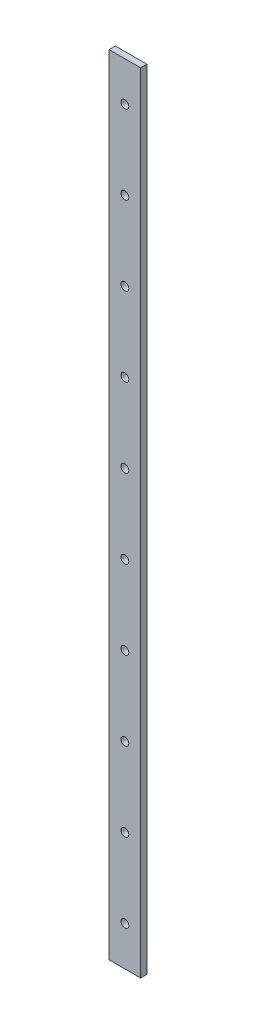
ISO-10303-21;
HEADER;
FILE_DESCRIPTION(('STEP AP214'),'2;1');
FILE_NAME('part.step','',(''),(''),'','','');
FILE_SCHEMA(('AUTOMOTIVE_DESIGN { 1 0 10303 214 1 1 1 1 }'));
ENDSEC;
DATA;
#1=APPLICATION_CONTEXT('core data for automotive mechanical design processes');
#2=APPLICATION_PROTOCOL_DEFINITION('international standard','automotive_design',2000,#1);
#3=PRODUCT_CONTEXT('',#1,'mechanical');
#4=PRODUCT('Part','Part','',(#3));
#5=PRODUCT_RELATED_PRODUCT_CATEGORY('part','',(#4));
#6=PRODUCT_DEFINITION_FORMATION('','',#4);
#7=PRODUCT_DEFINITION_CONTEXT('part definition',#1,'design');
#8=PRODUCT_DEFINITION('design','',#6,#7);
#9=PRODUCT_DEFINITION_SHAPE('','',#8);
#10=(LENGTH_UNIT() NAMED_UNIT(*) SI_UNIT(.MILLI.,.METRE.));
#11=(NAMED_UNIT(*) PLANE_ANGLE_UNIT() SI_UNIT($,.RADIAN.));
#12=(NAMED_UNIT(*) SI_UNIT($,.STERADIAN.) SOLID_ANGLE_UNIT());
#13=UNCERTAINTY_MEASURE_WITH_UNIT(LENGTH_MEASURE(1.E-05),#10,'distance_accuracy_value','');
#14=(GEOMETRIC_REPRESENTATION_CONTEXT(3) GLOBAL_UNCERTAINTY_ASSIGNED_CONTEXT((#13)) GLOBAL_UNIT_ASSIGNED_CONTEXT((#10,
#11,#12)) REPRESENTATION_CONTEXT('',''));
#15=CARTESIAN_POINT('',(0.,0.,0.));
#16=DIRECTION('',(0.,0.,1.));
#17=DIRECTION('',(1.,0.,0.));
#18=AXIS2_PLACEMENT_3D('',#15,#16,#17);
#19=CARTESIAN_POINT('',(10.,500.,-2.));
#20=DIRECTION('',(-1.,0.,0.));
#21=DIRECTION('',(0.,0.,1.));
#22=AXIS2_PLACEMENT_3D('',#19,#20,#21);
#23=PLANE('',#22);
#24=DIRECTION('',(0.,0.,-1.));
#25=VECTOR('',#24,1.);
#26=CARTESIAN_POINT('',(10.,0.,-2.));
#27=LINE('',#26,#25);
#28=CARTESIAN_POINT('',(10.,0.,2.));
#29=VERTEX_POINT('',#28);
#30=CARTESIAN_POINT('',(10.,0.,-2.));
#31=VERTEX_POINT('',#30);
#32=EDGE_CURVE('E98',#29,#31,#27,.T.);
#33=ORIENTED_EDGE('',*,*,#32,.T.);
#34=DIRECTION('',(0.,-1.,0.));
#35=VECTOR('',#34,1.);
#36=CARTESIAN_POINT('',(10.,500.,-2.));
#37=LINE('',#36,#35);
#38=CARTESIAN_POINT('',(10.,500.,-2.));
#39=VERTEX_POINT('',#38);
#40=EDGE_CURVE('E11',#39,#31,#37,.T.);
#41=ORIENTED_EDGE('',*,*,#40,.F.);
#42=DIRECTION('',(0.,0.,-1.));
#43=VECTOR('',#42,1.);
#44=CARTESIAN_POINT('',(10.,500.,-2.));
#45=LINE('',#44,#43);
#46=CARTESIAN_POINT('',(10.,500.,2.));
#47=VERTEX_POINT('',#46);
#48=EDGE_CURVE('E86',#47,#39,#45,.T.);
#49=ORIENTED_EDGE('',*,*,#48,.F.);
#50=DIRECTION('',(0.,-1.,0.));
#51=VECTOR('',#50,1.);
#52=CARTESIAN_POINT('',(10.,500.,2.));
#53=LINE('',#52,#51);
#54=EDGE_CURVE('E94',#47,#29,#53,.T.);
#55=ORIENTED_EDGE('',*,*,#54,.T.);
#56=EDGE_LOOP('',(#33,#41,#49,#55));
#57=FACE_BOUND('',#56,.T.);
#58=ADVANCED_FACE('F35',(#57),#23,.F.);
#59=CARTESIAN_POINT('',(-10.,500.,-2.));
#60=DIRECTION('',(0.,0.,1.));
#61=DIRECTION('',(1.,0.,0.));
#62=AXIS2_PLACEMENT_3D('',#59,#60,#61);
#63=PLANE('',#62);
#64=CARTESIAN_POINT('',(0.,25.,-2.));
#65=DIRECTION('',(0.,0.,1.));
#66=DIRECTION('',(1.,0.,0.));
#67=AXIS2_PLACEMENT_3D('',#64,#65,#66);
#68=CIRCLE('',#67,2.5);
#69=CARTESIAN_POINT('',(2.5,25.,-2.));
#70=VERTEX_POINT('',#69);
#71=EDGE_CURVE('E101',#70,#70,#68,.T.);
#72=ORIENTED_EDGE('',*,*,#71,.T.);
#73=EDGE_LOOP('',(#72));
#74=FACE_BOUND('',#73,.T.);
#75=CARTESIAN_POINT('',(-1.74574066942157E-13,75.,-2.));
#76=DIRECTION('',(0.,0.,1.));
#77=DIRECTION('',(1.,0.,0.));
#78=AXIS2_PLACEMENT_3D('',#75,#76,#77);
#79=CIRCLE('',#78,2.5);
#80=CARTESIAN_POINT('',(2.49999999999982,75.,-2.));
#81=VERTEX_POINT('',#80);
#82=EDGE_CURVE('E163',#81,#81,#79,.T.);
#83=ORIENTED_EDGE('',*,*,#82,.T.);
#84=EDGE_LOOP('',(#83));
#85=FACE_BOUND('',#84,.T.);
#86=CARTESIAN_POINT('',(-3.49148133884313E-13,125.,-2.));
#87=DIRECTION('',(0.,0.,1.));
#88=DIRECTION('',(1.,0.,0.));
#89=AXIS2_PLACEMENT_3D('',#86,#87,#88);
#90=CIRCLE('',#89,2.5);
#91=CARTESIAN_POINT('',(2.49999999999965,125.,-2.));
#92=VERTEX_POINT('',#91);
#93=EDGE_CURVE('E157',#92,#92,#90,.T.);
#94=ORIENTED_EDGE('',*,*,#93,.T.);
#95=EDGE_LOOP('',(#94));
#96=FACE_BOUND('',#95,.T.);
#97=CARTESIAN_POINT('',(-5.2372220082647E-13,175.,-2.));
#98=DIRECTION('',(0.,0.,1.));
#99=DIRECTION('',(1.,0.,0.));
#100=AXIS2_PLACEMENT_3D('',#97,#98,#99);
#101=CIRCLE('',#100,2.5);
#102=CARTESIAN_POINT('',(2.49999999999948,175.,-2.));
#103=VERTEX_POINT('',#102);
#104=EDGE_CURVE('E151',#103,#103,#101,.T.);
#105=ORIENTED_EDGE('',*,*,#104,.T.);
#106=EDGE_LOOP('',(#105));
#107=FACE_BOUND('',#106,.T.);
#108=CARTESIAN_POINT('',(-6.98296267768627E-13,225.,-2.));
#109=DIRECTION('',(0.,0.,1.));
#110=DIRECTION('',(1.,0.,0.));
#111=AXIS2_PLACEMENT_3D('',#108,#109,#110);
#112=CIRCLE('',#111,2.5);
#113=CARTESIAN_POINT('',(2.4999999999993,225.,-2.));
#114=VERTEX_POINT('',#113);
#115=EDGE_CURVE('E145',#114,#114,#112,.T.);
#116=ORIENTED_EDGE('',*,*,#115,.T.);
#117=EDGE_LOOP('',(#116));
#118=FACE_BOUND('',#117,.T.);
#119=CARTESIAN_POINT('',(-8.72870334710783E-13,275.,-2.));
#120=DIRECTION('',(0.,0.,1.));
#121=DIRECTION('',(1.,0.,0.));
#122=AXIS2_PLACEMENT_3D('',#119,#120,#121);
#123=CIRCLE('',#122,2.5);
#124=CARTESIAN_POINT('',(2.49999999999913,275.,-2.));
#125=VERTEX_POINT('',#124);
#126=EDGE_CURVE('E139',#125,#125,#123,.T.);
#127=ORIENTED_EDGE('',*,*,#126,.T.);
#128=EDGE_LOOP('',(#127));
#129=FACE_BOUND('',#128,.T.);
#130=CARTESIAN_POINT('',(-1.04744440165294E-12,325.,-2.));
#131=DIRECTION('',(0.,0.,1.));
#132=DIRECTION('',(1.,0.,0.));
#133=AXIS2_PLACEMENT_3D('',#130,#131,#132);
#134=CIRCLE('',#133,2.5);
#135=CARTESIAN_POINT('',(2.49999999999895,325.,-2.));
#136=VERTEX_POINT('',#135);
#137=EDGE_CURVE('E133',#136,#136,#134,.T.);
#138=ORIENTED_EDGE('',*,*,#137,.T.);
#139=EDGE_LOOP('',(#138));
#140=FACE_BOUND('',#139,.T.);
#141=CARTESIAN_POINT('',(-1.2220184685951E-12,375.,-2.));
#142=DIRECTION('',(0.,0.,1.));
#143=DIRECTION('',(1.,0.,0.));
#144=AXIS2_PLACEMENT_3D('',#141,#142,#143);
#145=CIRCLE('',#144,2.5);
#146=CARTESIAN_POINT('',(2.49999999999878,375.,-2.));
#147=VERTEX_POINT('',#146);
#148=EDGE_CURVE('E127',#147,#147,#145,.T.);
#149=ORIENTED_EDGE('',*,*,#148,.T.);
#150=EDGE_LOOP('',(#149));
#151=FACE_BOUND('',#150,.T.);
#152=CARTESIAN_POINT('',(-1.39659253553725E-12,425.,-2.));
#153=DIRECTION('',(0.,0.,1.));
#154=DIRECTION('',(1.,0.,0.));
#155=AXIS2_PLACEMENT_3D('',#152,#153,#154);
#156=CIRCLE('',#155,2.5);
#157=CARTESIAN_POINT('',(2.4999999999986,425.,-2.));
#158=VERTEX_POINT('',#157);
#159=EDGE_CURVE('E121',#158,#158,#156,.T.);
#160=ORIENTED_EDGE('',*,*,#159,.T.);
#161=EDGE_LOOP('',(#160));
#162=FACE_BOUND('',#161,.T.);
#163=CARTESIAN_POINT('',(-1.57116660247941E-12,475.,-2.));
#164=DIRECTION('',(0.,0.,1.));
#165=DIRECTION('',(1.,0.,0.));
#166=AXIS2_PLACEMENT_3D('',#163,#164,#165);
#167=CIRCLE('',#166,2.5);
#168=CARTESIAN_POINT('',(2.49999999999843,475.,-2.));
#169=VERTEX_POINT('',#168);
#170=EDGE_CURVE('E115',#169,#169,#167,.T.);
#171=ORIENTED_EDGE('',*,*,#170,.T.);
#172=EDGE_LOOP('',(#171));
#173=FACE_BOUND('',#172,.T.);
#174=DIRECTION('',(-1.,0.,0.));
#175=VECTOR('',#174,1.);
#176=CARTESIAN_POINT('',(-10.,0.,-2.));
#177=LINE('',#176,#175);
#178=CARTESIAN_POINT('',(-10.,0.,-2.));
#179=VERTEX_POINT('',#178);
#180=EDGE_CURVE('E90',#31,#179,#177,.T.);
#181=ORIENTED_EDGE('',*,*,#180,.T.);
#182=DIRECTION('',(0.,-1.,0.));
#183=VECTOR('',#182,1.);
#184=CARTESIAN_POINT('',(-10.,500.,-2.));
#185=LINE('',#184,#183);
#186=CARTESIAN_POINT('',(-10.,500.,-2.));
#187=VERTEX_POINT('',#186);
#188=EDGE_CURVE('E43',#187,#179,#185,.T.);
#189=ORIENTED_EDGE('',*,*,#188,.F.);
#190=DIRECTION('',(-1.,0.,0.));
#191=VECTOR('',#190,1.);
#192=CARTESIAN_POINT('',(-10.,500.,-2.));
#193=LINE('',#192,#191);
#194=EDGE_CURVE('E81',#39,#187,#193,.T.);
#195=ORIENTED_EDGE('',*,*,#194,.F.);
#196=ORIENTED_EDGE('',*,*,#40,.T.);
#197=EDGE_LOOP('',(#181,#189,#195,#196));
#198=FACE_BOUND('',#197,.T.);
#199=ADVANCED_FACE('F89',(#74,#85,#96,#107,#118,#129,#140,#151,#162,#173,#198),#63,.F.);
#200=CARTESIAN_POINT('',(-10.,500.,-2.));
#201=DIRECTION('',(1.,0.,0.));
#202=DIRECTION('',(0.,0.,-1.));
#203=AXIS2_PLACEMENT_3D('',#200,#201,#202);
#204=PLANE('',#203);
#205=DIRECTION('',(0.,0.,1.));
#206=VECTOR('',#205,1.);
#207=CARTESIAN_POINT('',(-10.,0.,-2.));
#208=LINE('',#207,#206);
#209=CARTESIAN_POINT('',(-10.,0.,2.));
#210=VERTEX_POINT('',#209);
#211=EDGE_CURVE('E68',#179,#210,#208,.T.);
#212=ORIENTED_EDGE('',*,*,#211,.T.);
#213=DIRECTION('',(0.,-1.,0.));
#214=VECTOR('',#213,1.);
#215=CARTESIAN_POINT('',(-10.,500.,2.));
#216=LINE('',#215,#214);
#217=CARTESIAN_POINT('',(-10.,500.,2.));
#218=VERTEX_POINT('',#217);
#219=EDGE_CURVE('E91',#218,#210,#216,.T.);
#220=ORIENTED_EDGE('',*,*,#219,.F.);
#221=DIRECTION('',(0.,0.,1.));
#222=VECTOR('',#221,1.);
#223=CARTESIAN_POINT('',(-10.,500.,-2.));
#224=LINE('',#223,#222);
#225=EDGE_CURVE('E84',#187,#218,#224,.T.);
#226=ORIENTED_EDGE('',*,*,#225,.F.);
#227=ORIENTED_EDGE('',*,*,#188,.T.);
#228=EDGE_LOOP('',(#212,#220,#226,#227));
#229=FACE_BOUND('',#228,.T.);
#230=ADVANCED_FACE('F92',(#229),#204,.F.);
#231=CARTESIAN_POINT('',(-10.,500.,2.));
#232=DIRECTION('',(0.,0.,-1.));
#233=DIRECTION('',(-1.,0.,0.));
#234=AXIS2_PLACEMENT_3D('',#231,#232,#233);
#235=PLANE('',#234);
#236=CARTESIAN_POINT('',(0.,25.,2.));
#237=DIRECTION('',(0.,0.,1.));
#238=DIRECTION('',(1.,0.,0.));
#239=AXIS2_PLACEMENT_3D('',#236,#237,#238);
#240=CIRCLE('',#239,2.5);
#241=CARTESIAN_POINT('',(2.5,25.,2.));
#242=VERTEX_POINT('',#241);
#243=EDGE_CURVE('E166',#242,#242,#240,.T.);
#244=ORIENTED_EDGE('',*,*,#243,.F.);
#245=EDGE_LOOP('',(#244));
#246=FACE_BOUND('',#245,.T.);
#247=CARTESIAN_POINT('',(-1.74574066942157E-13,75.,2.));
#248=DIRECTION('',(0.,0.,1.));
#249=DIRECTION('',(1.,0.,0.));
#250=AXIS2_PLACEMENT_3D('',#247,#248,#249);
#251=CIRCLE('',#250,2.5);
#252=CARTESIAN_POINT('',(2.49999999999982,75.,2.));
#253=VERTEX_POINT('',#252);
#254=EDGE_CURVE('E160',#253,#253,#251,.T.);
#255=ORIENTED_EDGE('',*,*,#254,.F.);
#256=EDGE_LOOP('',(#255));
#257=FACE_BOUND('',#256,.T.);
#258=CARTESIAN_POINT('',(-3.49148133884313E-13,125.,2.));
#259=DIRECTION('',(0.,0.,1.));
#260=DIRECTION('',(1.,0.,0.));
#261=AXIS2_PLACEMENT_3D('',#258,#259,#260);
#262=CIRCLE('',#261,2.5);
#263=CARTESIAN_POINT('',(2.49999999999965,125.,2.));
#264=VERTEX_POINT('',#263);
#265=EDGE_CURVE('E154',#264,#264,#262,.T.);
#266=ORIENTED_EDGE('',*,*,#265,.F.);
#267=EDGE_LOOP('',(#266));
#268=FACE_BOUND('',#267,.T.);
#269=CARTESIAN_POINT('',(-5.2372220082647E-13,175.,2.));
#270=DIRECTION('',(0.,0.,1.));
#271=DIRECTION('',(1.,0.,0.));
#272=AXIS2_PLACEMENT_3D('',#269,#270,#271);
#273=CIRCLE('',#272,2.5);
#274=CARTESIAN_POINT('',(2.49999999999948,175.,2.));
#275=VERTEX_POINT('',#274);
#276=EDGE_CURVE('E148',#275,#275,#273,.T.);
#277=ORIENTED_EDGE('',*,*,#276,.F.);
#278=EDGE_LOOP('',(#277));
#279=FACE_BOUND('',#278,.T.);
#280=CARTESIAN_POINT('',(-6.98296267768627E-13,225.,2.));
#281=DIRECTION('',(0.,0.,1.));
#282=DIRECTION('',(1.,0.,0.));
#283=AXIS2_PLACEMENT_3D('',#280,#281,#282);
#284=CIRCLE('',#283,2.5);
#285=CARTESIAN_POINT('',(2.4999999999993,225.,2.));
#286=VERTEX_POINT('',#285);
#287=EDGE_CURVE('E142',#286,#286,#284,.T.);
#288=ORIENTED_EDGE('',*,*,#287,.F.);
#289=EDGE_LOOP('',(#288));
#290=FACE_BOUND('',#289,.T.);
#291=CARTESIAN_POINT('',(-8.72870334710783E-13,275.,2.));
#292=DIRECTION('',(0.,0.,1.));
#293=DIRECTION('',(1.,0.,0.));
#294=AXIS2_PLACEMENT_3D('',#291,#292,#293);
#295=CIRCLE('',#294,2.5);
#296=CARTESIAN_POINT('',(2.49999999999913,275.,2.));
#297=VERTEX_POINT('',#296);
#298=EDGE_CURVE('E136',#297,#297,#295,.T.);
#299=ORIENTED_EDGE('',*,*,#298,.F.);
#300=EDGE_LOOP('',(#299));
#301=FACE_BOUND('',#300,.T.);
#302=CARTESIAN_POINT('',(-1.04744440165294E-12,325.,2.));
#303=DIRECTION('',(0.,0.,1.));
#304=DIRECTION('',(1.,0.,0.));
#305=AXIS2_PLACEMENT_3D('',#302,#303,#304);
#306=CIRCLE('',#305,2.5);
#307=CARTESIAN_POINT('',(2.49999999999895,325.,2.));
#308=VERTEX_POINT('',#307);
#309=EDGE_CURVE('E130',#308,#308,#306,.T.);
#310=ORIENTED_EDGE('',*,*,#309,.F.);
#311=EDGE_LOOP('',(#310));
#312=FACE_BOUND('',#311,.T.);
#313=CARTESIAN_POINT('',(-1.2220184685951E-12,375.,2.));
#314=DIRECTION('',(0.,0.,1.));
#315=DIRECTION('',(1.,0.,0.));
#316=AXIS2_PLACEMENT_3D('',#313,#314,#315);
#317=CIRCLE('',#316,2.5);
#318=CARTESIAN_POINT('',(2.49999999999878,375.,2.));
#319=VERTEX_POINT('',#318);
#320=EDGE_CURVE('E124',#319,#319,#317,.T.);
#321=ORIENTED_EDGE('',*,*,#320,.F.);
#322=EDGE_LOOP('',(#321));
#323=FACE_BOUND('',#322,.T.);
#324=CARTESIAN_POINT('',(-1.39659253553725E-12,425.,2.));
#325=DIRECTION('',(0.,0.,1.));
#326=DIRECTION('',(1.,0.,0.));
#327=AXIS2_PLACEMENT_3D('',#324,#325,#326);
#328=CIRCLE('',#327,2.5);
#329=CARTESIAN_POINT('',(2.4999999999986,425.,2.));
#330=VERTEX_POINT('',#329);
#331=EDGE_CURVE('E118',#330,#330,#328,.T.);
#332=ORIENTED_EDGE('',*,*,#331,.F.);
#333=EDGE_LOOP('',(#332));
#334=FACE_BOUND('',#333,.T.);
#335=CARTESIAN_POINT('',(-1.57116660247941E-12,475.,2.));
#336=DIRECTION('',(0.,0.,1.));
#337=DIRECTION('',(1.,0.,0.));
#338=AXIS2_PLACEMENT_3D('',#335,#336,#337);
#339=CIRCLE('',#338,2.5);
#340=CARTESIAN_POINT('',(2.49999999999843,475.,2.));
#341=VERTEX_POINT('',#340);
#342=EDGE_CURVE('E112',#341,#341,#339,.T.);
#343=ORIENTED_EDGE('',*,*,#342,.F.);
#344=EDGE_LOOP('',(#343));
#345=FACE_BOUND('',#344,.T.);
#346=DIRECTION('',(1.,0.,0.));
#347=VECTOR('',#346,1.);
#348=CARTESIAN_POINT('',(-10.,0.,2.));
#349=LINE('',#348,#347);
#350=EDGE_CURVE('E74',#210,#29,#349,.T.);
#351=ORIENTED_EDGE('',*,*,#350,.T.);
#352=ORIENTED_EDGE('',*,*,#54,.F.);
#353=DIRECTION('',(1.,0.,0.));
#354=VECTOR('',#353,1.);
#355=CARTESIAN_POINT('',(-10.,500.,2.));
#356=LINE('',#355,#354);
#357=EDGE_CURVE('E51',#218,#47,#356,.T.);
#358=ORIENTED_EDGE('',*,*,#357,.F.);
#359=ORIENTED_EDGE('',*,*,#219,.T.);
#360=EDGE_LOOP('',(#351,#352,#358,#359));
#361=FACE_BOUND('',#360,.T.);
#362=ADVANCED_FACE('F106',(#246,#257,#268,#279,#290,#301,#312,#323,#334,#345,#361),#235,.F.);
#363=CARTESIAN_POINT('',(0.,500.,0.));
#364=DIRECTION('',(0.,1.,0.));
#365=DIRECTION('',(0.,0.,1.));
#366=AXIS2_PLACEMENT_3D('',#363,#364,#365);
#367=PLANE('',#366);
#368=ORIENTED_EDGE('',*,*,#48,.T.);
#369=ORIENTED_EDGE('',*,*,#194,.T.);
#370=ORIENTED_EDGE('',*,*,#225,.T.);
#371=ORIENTED_EDGE('',*,*,#357,.T.);
#372=EDGE_LOOP('',(#368,#369,#370,#371));
#373=FACE_BOUND('',#372,.T.);
#374=ADVANCED_FACE('F82',(#373),#367,.T.);
#375=CARTESIAN_POINT('',(0.,0.,0.));
#376=DIRECTION('',(0.,1.,0.));
#377=DIRECTION('',(0.,0.,1.));
#378=AXIS2_PLACEMENT_3D('',#375,#376,#377);
#379=PLANE('',#378);
#380=ORIENTED_EDGE('',*,*,#32,.F.);
#381=ORIENTED_EDGE('',*,*,#350,.F.);
#382=ORIENTED_EDGE('',*,*,#211,.F.);
#383=ORIENTED_EDGE('',*,*,#180,.F.);
#384=EDGE_LOOP('',(#380,#381,#382,#383));
#385=FACE_BOUND('',#384,.T.);
#386=ADVANCED_FACE('F109',(#385),#379,.F.);
#387=CARTESIAN_POINT('',(-1.57116660247941E-12,475.,-2.));
#388=DIRECTION('',(0.,0.,1.));
#389=DIRECTION('',(1.,0.,0.));
#390=AXIS2_PLACEMENT_3D('',#387,#388,#389);
#391=CYLINDRICAL_SURFACE('',#390,2.5);
#392=ORIENTED_EDGE('',*,*,#170,.F.);
#393=EDGE_LOOP('',(#392));
#394=FACE_BOUND('',#393,.T.);
#395=ORIENTED_EDGE('',*,*,#342,.T.);
#396=EDGE_LOOP('',(#395));
#397=FACE_BOUND('',#396,.T.);
#398=ADVANCED_FACE('F202',(#394,#397),#391,.F.);
#399=CARTESIAN_POINT('',(-1.39659253553725E-12,425.,-2.));
#400=DIRECTION('',(0.,0.,1.));
#401=DIRECTION('',(1.,0.,0.));
#402=AXIS2_PLACEMENT_3D('',#399,#400,#401);
#403=CYLINDRICAL_SURFACE('',#402,2.5);
#404=ORIENTED_EDGE('',*,*,#159,.F.);
#405=EDGE_LOOP('',(#404));
#406=FACE_BOUND('',#405,.T.);
#407=ORIENTED_EDGE('',*,*,#331,.T.);
#408=EDGE_LOOP('',(#407));
#409=FACE_BOUND('',#408,.T.);
#410=ADVANCED_FACE('F204',(#406,#409),#403,.F.);
#411=CARTESIAN_POINT('',(-1.2220184685951E-12,375.,-2.));
#412=DIRECTION('',(0.,0.,1.));
#413=DIRECTION('',(1.,0.,0.));
#414=AXIS2_PLACEMENT_3D('',#411,#412,#413);
#415=CYLINDRICAL_SURFACE('',#414,2.5);
#416=ORIENTED_EDGE('',*,*,#148,.F.);
#417=EDGE_LOOP('',(#416));
#418=FACE_BOUND('',#417,.T.);
#419=ORIENTED_EDGE('',*,*,#320,.T.);
#420=EDGE_LOOP('',(#419));
#421=FACE_BOUND('',#420,.T.);
#422=ADVANCED_FACE('F211',(#418,#421),#415,.F.);
#423=CARTESIAN_POINT('',(-1.04744440165294E-12,325.,-2.));
#424=DIRECTION('',(0.,0.,1.));
#425=DIRECTION('',(1.,0.,0.));
#426=AXIS2_PLACEMENT_3D('',#423,#424,#425);
#427=CYLINDRICAL_SURFACE('',#426,2.5);
#428=ORIENTED_EDGE('',*,*,#137,.F.);
#429=EDGE_LOOP('',(#428));
#430=FACE_BOUND('',#429,.T.);
#431=ORIENTED_EDGE('',*,*,#309,.T.);
#432=EDGE_LOOP('',(#431));
#433=FACE_BOUND('',#432,.T.);
#434=ADVANCED_FACE('F257',(#430,#433),#427,.F.);
#435=CARTESIAN_POINT('',(-8.72870334710783E-13,275.,-2.));
#436=DIRECTION('',(0.,0.,1.));
#437=DIRECTION('',(1.,0.,0.));
#438=AXIS2_PLACEMENT_3D('',#435,#436,#437);
#439=CYLINDRICAL_SURFACE('',#438,2.5);
#440=ORIENTED_EDGE('',*,*,#126,.F.);
#441=EDGE_LOOP('',(#440));
#442=FACE_BOUND('',#441,.T.);
#443=ORIENTED_EDGE('',*,*,#298,.T.);
#444=EDGE_LOOP('',(#443));
#445=FACE_BOUND('',#444,.T.);
#446=ADVANCED_FACE('F266',(#442,#445),#439,.F.);
#447=CARTESIAN_POINT('',(-6.98296267768627E-13,225.,-2.));
#448=DIRECTION('',(0.,0.,1.));
#449=DIRECTION('',(1.,0.,0.));
#450=AXIS2_PLACEMENT_3D('',#447,#448,#449);
#451=CYLINDRICAL_SURFACE('',#450,2.5);
#452=ORIENTED_EDGE('',*,*,#115,.F.);
#453=EDGE_LOOP('',(#452));
#454=FACE_BOUND('',#453,.T.);
#455=ORIENTED_EDGE('',*,*,#287,.T.);
#456=EDGE_LOOP('',(#455));
#457=FACE_BOUND('',#456,.T.);
#458=ADVANCED_FACE('F275',(#454,#457),#451,.F.);
#459=CARTESIAN_POINT('',(-5.2372220082647E-13,175.,-2.));
#460=DIRECTION('',(0.,0.,1.));
#461=DIRECTION('',(1.,0.,0.));
#462=AXIS2_PLACEMENT_3D('',#459,#460,#461);
#463=CYLINDRICAL_SURFACE('',#462,2.5);
#464=ORIENTED_EDGE('',*,*,#104,.F.);
#465=EDGE_LOOP('',(#464));
#466=FACE_BOUND('',#465,.T.);
#467=ORIENTED_EDGE('',*,*,#276,.T.);
#468=EDGE_LOOP('',(#467));
#469=FACE_BOUND('',#468,.T.);
#470=ADVANCED_FACE('F284',(#466,#469),#463,.F.);
#471=CARTESIAN_POINT('',(-3.49148133884313E-13,125.,-2.));
#472=DIRECTION('',(0.,0.,1.));
#473=DIRECTION('',(1.,0.,0.));
#474=AXIS2_PLACEMENT_3D('',#471,#472,#473);
#475=CYLINDRICAL_SURFACE('',#474,2.5);
#476=ORIENTED_EDGE('',*,*,#93,.F.);
#477=EDGE_LOOP('',(#476));
#478=FACE_BOUND('',#477,.T.);
#479=ORIENTED_EDGE('',*,*,#265,.T.);
#480=EDGE_LOOP('',(#479));
#481=FACE_BOUND('',#480,.T.);
#482=ADVANCED_FACE('F293',(#478,#481),#475,.F.);
#483=CARTESIAN_POINT('',(-1.74574066942157E-13,75.,-2.));
#484=DIRECTION('',(0.,0.,1.));
#485=DIRECTION('',(1.,0.,0.));
#486=AXIS2_PLACEMENT_3D('',#483,#484,#485);
#487=CYLINDRICAL_SURFACE('',#486,2.5);
#488=ORIENTED_EDGE('',*,*,#82,.F.);
#489=EDGE_LOOP('',(#488));
#490=FACE_BOUND('',#489,.T.);
#491=ORIENTED_EDGE('',*,*,#254,.T.);
#492=EDGE_LOOP('',(#491));
#493=FACE_BOUND('',#492,.T.);
#494=ADVANCED_FACE('F177',(#490,#493),#487,.F.);
#495=CARTESIAN_POINT('',(0.,25.,-2.));
#496=DIRECTION('',(0.,0.,1.));
#497=DIRECTION('',(1.,0.,0.));
#498=AXIS2_PLACEMENT_3D('',#495,#496,#497);
#499=CYLINDRICAL_SURFACE('',#498,2.5);
#500=ORIENTED_EDGE('',*,*,#71,.F.);
#501=EDGE_LOOP('',(#500));
#502=FACE_BOUND('',#501,.T.);
#503=ORIENTED_EDGE('',*,*,#243,.T.);
#504=EDGE_LOOP('',(#503));
#505=FACE_BOUND('',#504,.T.);
#506=ADVANCED_FACE('F174',(#502,#505),#499,.F.);
#507=CLOSED_SHELL('',(#58,#199,#230,#362,#374,#386,#398,#410,#422,#434,#446,#458,#470,#482,#494,#506));
#508=MANIFOLD_SOLID_BREP('B2',#507);
#509=ADVANCED_BREP_SHAPE_REPRESENTATION('',(#18,#508),#14);
#510=SHAPE_DEFINITION_REPRESENTATION(#9,#509);
ENDSEC;
END-ISO-10303-21;
